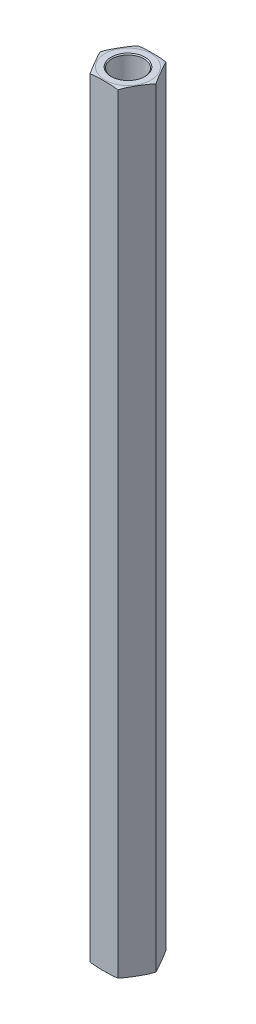
ISO-10303-21;
HEADER;
FILE_DESCRIPTION(('STEP AP214'),'2;1');
FILE_NAME('part.step','',(''),(''),'','','');
FILE_SCHEMA(('AUTOMOTIVE_DESIGN { 1 0 10303 214 1 1 1 1 }'));
ENDSEC;
DATA;
#1=APPLICATION_CONTEXT('core data for automotive mechanical design processes');
#2=APPLICATION_PROTOCOL_DEFINITION('international standard','automotive_design',2000,#1);
#3=PRODUCT_CONTEXT('',#1,'mechanical');
#4=PRODUCT('Part','Part','',(#3));
#5=PRODUCT_RELATED_PRODUCT_CATEGORY('part','',(#4));
#6=PRODUCT_DEFINITION_FORMATION('','',#4);
#7=PRODUCT_DEFINITION_CONTEXT('part definition',#1,'design');
#8=PRODUCT_DEFINITION('design','',#6,#7);
#9=PRODUCT_DEFINITION_SHAPE('','',#8);
#10=(LENGTH_UNIT() NAMED_UNIT(*) SI_UNIT(.MILLI.,.METRE.));
#11=(NAMED_UNIT(*) PLANE_ANGLE_UNIT() SI_UNIT($,.RADIAN.));
#12=(NAMED_UNIT(*) SI_UNIT($,.STERADIAN.) SOLID_ANGLE_UNIT());
#13=UNCERTAINTY_MEASURE_WITH_UNIT(LENGTH_MEASURE(1.E-05),#10,'distance_accuracy_value','');
#14=(GEOMETRIC_REPRESENTATION_CONTEXT(3) GLOBAL_UNCERTAINTY_ASSIGNED_CONTEXT((#13)) GLOBAL_UNIT_ASSIGNED_CONTEXT((#10,
#11,#12)) REPRESENTATION_CONTEXT('',''));
#15=CARTESIAN_POINT('',(0.,0.,0.));
#16=DIRECTION('',(0.,0.,1.));
#17=DIRECTION('',(1.,0.,0.));
#18=AXIS2_PLACEMENT_3D('',#15,#16,#17);
#19=CARTESIAN_POINT('',(0.,38.1,0.));
#20=DIRECTION('',(0.,1.,0.));
#21=DIRECTION('',(0.,0.,1.));
#22=AXIS2_PLACEMENT_3D('',#19,#20,#21);
#23=PLANE('',#22);
#24=CARTESIAN_POINT('',(0.,38.1,0.));
#25=DIRECTION('',(0.,1.,0.));
#26=DIRECTION('',(0.,0.,1.));
#27=AXIS2_PLACEMENT_3D('',#24,#25,#26);
#28=CIRCLE('',#27,2.0955);
#29=CARTESIAN_POINT('',(0.,38.1,2.0955));
#30=VERTEX_POINT('',#29);
#31=EDGE_CURVE('E437',#30,#30,#28,.T.);
#32=ORIENTED_EDGE('',*,*,#31,.T.);
#33=EDGE_LOOP('',(#32));
#34=FACE_BOUND('',#33,.T.);
#35=ADVANCED_FACE('F17',(#34),#23,.T.);
#36=CARTESIAN_POINT('',(0.,-38.1,0.));
#37=DIRECTION('',(0.,-1.,0.));
#38=DIRECTION('',(0.,0.,-1.));
#39=AXIS2_PLACEMENT_3D('',#36,#37,#38);
#40=PLANE('',#39);
#41=CARTESIAN_POINT('',(0.,-38.1,0.));
#42=DIRECTION('',(0.,-1.,0.));
#43=DIRECTION('',(0.,0.,-1.));
#44=AXIS2_PLACEMENT_3D('',#41,#42,#43);
#45=CIRCLE('',#44,2.0955);
#46=CARTESIAN_POINT('',(0.,-38.1,-2.0955));
#47=VERTEX_POINT('',#46);
#48=EDGE_CURVE('E130',#47,#47,#45,.T.);
#49=ORIENTED_EDGE('',*,*,#48,.T.);
#50=EDGE_LOOP('',(#49));
#51=FACE_BOUND('',#50,.T.);
#52=ADVANCED_FACE('F405',(#51),#40,.T.);
#53=CARTESIAN_POINT('',(0.,38.1,0.));
#54=DIRECTION('',(0.,1.,0.));
#55=DIRECTION('',(0.,0.,1.));
#56=AXIS2_PLACEMENT_3D('',#53,#54,#55);
#57=CYLINDRICAL_SURFACE('',#56,2.0955);
#58=CARTESIAN_POINT('',(0.,50.6729999999607,0.));
#59=DIRECTION('',(0.,1.,0.));
#60=DIRECTION('',(0.,0.,1.));
#61=AXIS2_PLACEMENT_3D('',#58,#59,#60);
#62=CIRCLE('',#61,2.09549999999581);
#63=CARTESIAN_POINT('',(0.,50.6729999999607,2.09549999999581));
#64=VERTEX_POINT('',#63);
#65=EDGE_CURVE('E128',#64,#64,#62,.T.);
#66=ORIENTED_EDGE('',*,*,#65,.T.);
#67=EDGE_LOOP('',(#66));
#68=FACE_BOUND('',#67,.T.);
#69=ORIENTED_EDGE('',*,*,#31,.F.);
#70=EDGE_LOOP('',(#69));
#71=FACE_BOUND('',#70,.T.);
#72=ADVANCED_FACE('F396',(#68,#71),#57,.F.);
#73=CARTESIAN_POINT('',(0.,-38.1,0.));
#74=DIRECTION('',(0.,-1.,0.));
#75=DIRECTION('',(0.,0.,-1.));
#76=AXIS2_PLACEMENT_3D('',#73,#74,#75);
#77=CYLINDRICAL_SURFACE('',#76,2.0955);
#78=ORIENTED_EDGE('',*,*,#48,.F.);
#79=EDGE_LOOP('',(#78));
#80=FACE_BOUND('',#79,.T.);
#81=CARTESIAN_POINT('',(0.,-50.6729999999607,0.));
#82=DIRECTION('',(0.,-1.,0.));
#83=DIRECTION('',(0.,0.,-1.));
#84=AXIS2_PLACEMENT_3D('',#81,#82,#83);
#85=CIRCLE('',#84,2.09550000005265);
#86=CARTESIAN_POINT('',(0.,-50.6729999999607,-2.09550000005265));
#87=VERTEX_POINT('',#86);
#88=EDGE_CURVE('E93',#87,#87,#85,.T.);
#89=ORIENTED_EDGE('',*,*,#88,.T.);
#90=EDGE_LOOP('',(#89));
#91=FACE_BOUND('',#90,.T.);
#92=ADVANCED_FACE('F387',(#80,#91),#77,.F.);
#93=CARTESIAN_POINT('',(0.,50.7999999999811,0.));
#94=DIRECTION('',(0.,1.,0.));
#95=DIRECTION('',(0.,0.,1.));
#96=AXIS2_PLACEMENT_3D('',#93,#94,#95);
#97=CONICAL_SURFACE('',#96,2.22249999995938,0.785398163173655);
#98=CARTESIAN_POINT('',(0.,50.7999999999811,0.));
#99=DIRECTION('',(0.,1.,0.));
#100=DIRECTION('',(0.,0.,1.));
#101=AXIS2_PLACEMENT_3D('',#98,#99,#100);
#102=CIRCLE('',#101,2.22249999995938);
#103=CARTESIAN_POINT('',(0.,50.7999999999811,2.22249999995938));
#104=VERTEX_POINT('',#103);
#105=EDGE_CURVE('E205',#104,#104,#102,.T.);
#106=ORIENTED_EDGE('',*,*,#105,.T.);
#107=EDGE_LOOP('',(#106));
#108=FACE_BOUND('',#107,.T.);
#109=ORIENTED_EDGE('',*,*,#65,.F.);
#110=EDGE_LOOP('',(#109));
#111=FACE_BOUND('',#110,.T.);
#112=ADVANCED_FACE('F379',(#108,#111),#97,.F.);
#113=CARTESIAN_POINT('',(0.,-50.7999999999242,0.));
#114=DIRECTION('',(0.,-1.,0.));
#115=DIRECTION('',(1.,0.,0.));
#116=AXIS2_PLACEMENT_3D('',#113,#114,#115);
#117=CONICAL_SURFACE('',#116,2.22249999995938,0.785398163397448);
#118=ORIENTED_EDGE('',*,*,#88,.F.);
#119=EDGE_LOOP('',(#118));
#120=FACE_BOUND('',#119,.T.);
#121=CARTESIAN_POINT('',(0.,-50.7999999999811,0.));
#122=DIRECTION('',(0.,-1.,0.));
#123=DIRECTION('',(1.,0.,0.));
#124=AXIS2_PLACEMENT_3D('',#121,#122,#123);
#125=CIRCLE('',#124,2.22250000001623);
#126=CARTESIAN_POINT('',(2.22250000001623,-50.7999999999811,0.));
#127=VERTEX_POINT('',#126);
#128=EDGE_CURVE('E200',#127,#127,#125,.F.);
#129=ORIENTED_EDGE('',*,*,#128,.F.);
#130=EDGE_LOOP('',(#129));
#131=FACE_BOUND('',#130,.T.);
#132=ADVANCED_FACE('F372',(#120,#131),#117,.F.);
#133=CARTESIAN_POINT('',(1.83308710467706,50.8,3.17499999999999));
#134=DIRECTION('',(-0.866025403784439,0.,-0.5));
#135=DIRECTION('',(-0.5,0.,0.866025403784439));
#136=AXIS2_PLACEMENT_3D('',#133,#134,#135);
#137=PLANE('',#136);
#138=DIRECTION('',(0.,1.,0.));
#139=VECTOR('',#138,1.);
#140=CARTESIAN_POINT('',(3.66617420935412,50.8,0.));
#141=LINE('',#140,#139);
#142=CARTESIAN_POINT('',(3.66617420935412,-50.673,0.));
#143=VERTEX_POINT('',#142);
#144=CARTESIAN_POINT('',(3.66617420935412,50.673,0.));
#145=VERTEX_POINT('',#144);
#146=EDGE_CURVE('E75',#143,#145,#141,.T.);
#147=ORIENTED_EDGE('',*,*,#146,.T.);
#148=CARTESIAN_POINT('',(1.83308710467706,50.673,3.175));
#149=CARTESIAN_POINT('',(1.87128169935724,50.6889014148997,3.10884502143944));
#150=CARTESIAN_POINT('',(1.90969320538961,50.7024886076105,3.04231434139612));
#151=CARTESIAN_POINT('',(1.98677079607407,50.7258161979402,2.90881203820563));
#152=CARTESIAN_POINT('',(2.02543658353272,50.7355604771397,2.8418409298126));
#153=CARTESIAN_POINT('',(2.10284499535245,50.7519966530451,2.70776562760761));
#154=CARTESIAN_POINT('',(2.14158731769806,50.7586945328669,2.64066195690181));
#155=CARTESIAN_POINT('',(2.21916296783005,50.7697767572932,2.50629698944301));
#156=CARTESIAN_POINT('',(2.25799631815347,50.774160450474,2.43903565365472));
#157=CARTESIAN_POINT('',(2.33572065438804,50.7812403004263,2.30441315431189));
#158=CARTESIAN_POINT('',(2.37461166028642,50.7839355237591,2.23705195613842));
#159=CARTESIAN_POINT('',(2.45240986808526,50.7881531983713,2.10230150749304));
#160=CARTESIAN_POINT('',(2.49131707051149,50.7896756080272,2.03491225611044));
#161=CARTESIAN_POINT('',(2.56874613804245,50.791922705889,1.90080117716413));
#162=CARTESIAN_POINT('',(2.60726795154184,50.7926552468181,1.8340794389835));
#163=CARTESIAN_POINT('',(2.68431353056975,50.7935767302574,1.7006325816086));
#164=CARTESIAN_POINT('',(2.72283729611679,50.7937656658949,1.63390746238225));
#165=CARTESIAN_POINT('',(2.79990166972106,50.7936659966806,1.50042805184618));
#166=CARTESIAN_POINT('',(2.83844227771297,50.7933771811766,1.4336737606496));
#167=CARTESIAN_POINT('',(2.91552223317789,50.792221986219,1.30016736153922));
#168=CARTESIAN_POINT('',(2.95406158061873,50.7913555970386,1.23341525368112));
#169=CARTESIAN_POINT('',(3.03113161773348,50.7887861940656,1.09992603365716));
#170=CARTESIAN_POINT('',(3.06966230777154,50.7870832271616,1.03318892086056));
#171=CARTESIAN_POINT('',(3.1467048006221,50.7824387229726,0.899747408901619));
#172=CARTESIAN_POINT('',(3.18521660427676,50.7794972471358,0.833043008280634));
#173=CARTESIAN_POINT('',(3.24841925163174,50.7732174124749,0.723572811888951));
#174=CARTESIAN_POINT('',(3.27312282066109,50.7703980110463,0.680784975201837));
#175=CARTESIAN_POINT('',(3.32249186130891,50.7638696794304,0.595275288478879));
#176=CARTESIAN_POINT('',(3.34715734368935,50.7601610809139,0.552553419802756));
#177=CARTESIAN_POINT('',(3.39643377591422,50.7516802711497,0.467204135573549));
#178=CARTESIAN_POINT('',(3.42104474295589,50.7469084657008,0.424576690233975));
#179=CARTESIAN_POINT('',(3.47026036719569,50.7360987712516,0.339332728524436));
#180=CARTESIAN_POINT('',(3.49486485317655,50.7300577313084,0.296716508711466));
#181=CARTESIAN_POINT('',(3.54398805502185,50.7165138354161,0.211632627284947));
#182=CARTESIAN_POINT('',(3.56850671785504,50.709010197803,0.169165057524208));
#183=CARTESIAN_POINT('',(3.61743974029947,50.6923203507084,0.0844105764825507));
#184=CARTESIAN_POINT('',(3.64185387349848,50.6831314978033,0.0421240573591031));
#185=CARTESIAN_POINT('',(3.66617420935412,50.673,0.));
#186=B_SPLINE_CURVE_WITH_KNOTS('',3,(#148,#149,#150,#151,#152,#153,#154,#155,#156,#157,#158,
#159,#160,#161,#162,#163,#164,#165,#166,#167,#168,#169,#170,#171,#172,#173,#174,#175,#176,#177,
#178,#179,#180,#181,#182,#183,#184,#185),.UNSPECIFIED.,.F.,.F.,(4,2,2,2,2,2,2,2,2,2,2,2,2,2,2,2,
2,2,4),(0.,0.233977307817941,0.467717675040694,0.7009969735575,0.934341903229751,
1.1678157196724,1.40129782179825,1.6324366580967,1.86357841666617,2.09482211846294,
2.32606971471495,2.55730435147398,2.78852751694413,2.93698369265087,3.08538458004473,
3.23372892334584,3.38244598546612,3.53124274626083,3.68027493713584),.UNSPECIFIED.);
#187=CARTESIAN_POINT('',(1.83308710467706,50.673,3.17499999999999));
#188=VERTEX_POINT('',#187);
#189=EDGE_CURVE('E99',#188,#145,#186,.T.);
#190=ORIENTED_EDGE('',*,*,#189,.F.);
#191=DIRECTION('',(0.,1.,0.));
#192=VECTOR('',#191,1.);
#193=CARTESIAN_POINT('',(1.83308710467706,50.8,3.17499999999999));
#194=LINE('',#193,#192);
#195=CARTESIAN_POINT('',(1.83308710467706,-50.673,3.17499999999999));
#196=VERTEX_POINT('',#195);
#197=EDGE_CURVE('E92',#188,#196,#194,.F.);
#198=ORIENTED_EDGE('',*,*,#197,.T.);
#199=CARTESIAN_POINT('',(3.66617420935412,-50.673,0.));
#200=CARTESIAN_POINT('',(3.62797961467395,-50.6889014148997,0.066154978560558));
#201=CARTESIAN_POINT('',(3.58956810864157,-50.7024886076105,0.132685658603875));
#202=CARTESIAN_POINT('',(3.51249051795711,-50.7258161979402,0.266187961794359));
#203=CARTESIAN_POINT('',(3.47382473049846,-50.7355604771397,0.33315907018739));
#204=CARTESIAN_POINT('',(3.39641631867873,-50.7519966530451,0.467234372392382));
#205=CARTESIAN_POINT('',(3.35767399633312,-50.7586945328669,0.534338043098185));
#206=CARTESIAN_POINT('',(3.28009834620113,-50.7697767572932,0.668703010556983));
#207=CARTESIAN_POINT('',(3.24126499587771,-50.774160450474,0.735964346345271));
#208=CARTESIAN_POINT('',(3.16354065964315,-50.7812403004263,0.870586845688102));
#209=CARTESIAN_POINT('',(3.12464965374476,-50.7839355237591,0.937948043861573));
#210=CARTESIAN_POINT('',(3.04685144594593,-50.7881531983713,1.07269849250695));
#211=CARTESIAN_POINT('',(3.00794424351969,-50.7896756080272,1.14008774388956));
#212=CARTESIAN_POINT('',(2.93051517598873,-50.791922705889,1.27419882283586));
#213=CARTESIAN_POINT('',(2.89199336248934,-50.7926552468181,1.34092056101649));
#214=CARTESIAN_POINT('',(2.81494778346143,-50.7935767302574,1.4743674183914));
#215=CARTESIAN_POINT('',(2.77642401791439,-50.7937656658949,1.54109253761775));
#216=CARTESIAN_POINT('',(2.69935964431012,-50.7936659966806,1.67457194815381));
#217=CARTESIAN_POINT('',(2.66081903631821,-50.7933771811766,1.7413262393504));
#218=CARTESIAN_POINT('',(2.58373908085329,-50.792221986219,1.87483263846078));
#219=CARTESIAN_POINT('',(2.54519973341245,-50.7913555970386,1.94158474631887));
#220=CARTESIAN_POINT('',(2.4681296962977,-50.7887861940656,2.07507396634283));
#221=CARTESIAN_POINT('',(2.42959900625965,-50.7870832271616,2.14181107913943));
#222=CARTESIAN_POINT('',(2.35255651340908,-50.7824387229726,2.27525259109837));
#223=CARTESIAN_POINT('',(2.31404470975442,-50.7794972471358,2.34195699171936));
#224=CARTESIAN_POINT('',(2.25084206239944,-50.7732174124749,2.45142718811104));
#225=CARTESIAN_POINT('',(2.2261384933701,-50.7703980110463,2.49421502479816));
#226=CARTESIAN_POINT('',(2.17676945272228,-50.7638696794304,2.57972471152112));
#227=CARTESIAN_POINT('',(2.15210397034183,-50.7601610809139,2.62244658019724));
#228=CARTESIAN_POINT('',(2.10282753811696,-50.7516802711497,2.70779586442645));
#229=CARTESIAN_POINT('',(2.07821657107529,-50.7469084657008,2.75042330976602));
#230=CARTESIAN_POINT('',(2.02900094683549,-50.7360987712516,2.83566727147556));
#231=CARTESIAN_POINT('',(2.00439646085463,-50.7300577313084,2.87828349128853));
#232=CARTESIAN_POINT('',(1.95527325900933,-50.7165138354161,2.96336737271505));
#233=CARTESIAN_POINT('',(1.93075459617614,-50.709010197803,3.00583494247579));
#234=CARTESIAN_POINT('',(1.88182157373171,-50.6923203507084,3.09058942351745));
#235=CARTESIAN_POINT('',(1.8574074405327,-50.6831314978033,3.13287594264089));
#236=CARTESIAN_POINT('',(1.83308710467706,-50.673,3.175));
#237=B_SPLINE_CURVE_WITH_KNOTS('',3,(#199,#200,#201,#202,#203,#204,#205,#206,#207,#208,#209,
#210,#211,#212,#213,#214,#215,#216,#217,#218,#219,#220,#221,#222,#223,#224,#225,#226,#227,#228,
#229,#230,#231,#232,#233,#234,#235,#236),.UNSPECIFIED.,.F.,.F.,(4,2,2,2,2,2,2,2,2,2,2,2,2,2,2,2,
2,2,4),(0.,0.233977307817942,0.467717675040694,0.7009969735575,0.934341903229751,
1.1678157196724,1.40129782179825,1.6324366580967,1.86357841666617,2.09482211846294,
2.32606971471495,2.55730435147398,2.78852751694413,2.93698369265087,3.08538458004473,
3.23372892334584,3.38244598546612,3.53124274626084,3.68027493713585),.UNSPECIFIED.);
#238=EDGE_CURVE('E86',#143,#196,#237,.T.);
#239=ORIENTED_EDGE('',*,*,#238,.F.);
#240=EDGE_LOOP('',(#147,#190,#198,#239));
#241=FACE_BOUND('',#240,.T.);
#242=ADVANCED_FACE('F90',(#241),#137,.F.);
#243=CARTESIAN_POINT('',(3.66617420935412,50.8,0.));
#244=DIRECTION('',(-0.866025403784439,0.,0.5));
#245=DIRECTION('',(0.5,0.,0.866025403784439));
#246=AXIS2_PLACEMENT_3D('',#243,#244,#245);
#247=PLANE('',#246);
#248=DIRECTION('',(0.,1.,0.));
#249=VECTOR('',#248,1.);
#250=CARTESIAN_POINT('',(1.83308710467706,50.8,-3.175));
#251=LINE('',#250,#249);
#252=CARTESIAN_POINT('',(1.83308710467706,-50.673,-3.175));
#253=VERTEX_POINT('',#252);
#254=CARTESIAN_POINT('',(1.83308710467706,50.673,-3.175));
#255=VERTEX_POINT('',#254);
#256=EDGE_CURVE('E164',#253,#255,#251,.T.);
#257=ORIENTED_EDGE('',*,*,#256,.T.);
#258=CARTESIAN_POINT('',(3.66617420935412,50.673,0.));
#259=CARTESIAN_POINT('',(3.62797961467395,50.6889014148997,-0.0661549785605553));
#260=CARTESIAN_POINT('',(3.58956810864157,50.7024886076105,-0.132685658603872));
#261=CARTESIAN_POINT('',(3.51249051795711,50.7258161979402,-0.266187961794356));
#262=CARTESIAN_POINT('',(3.47382473049846,50.7355604771397,-0.333159070187387));
#263=CARTESIAN_POINT('',(3.39641631867873,50.7519966530451,-0.467234372392379));
#264=CARTESIAN_POINT('',(3.35767399633312,50.7586945328669,-0.534338043098182));
#265=CARTESIAN_POINT('',(3.28009834620113,50.7697767572932,-0.66870301055698));
#266=CARTESIAN_POINT('',(3.24126499587771,50.774160450474,-0.735964346345267));
#267=CARTESIAN_POINT('',(3.16354065964315,50.7812403004263,-0.870586845688098));
#268=CARTESIAN_POINT('',(3.12464965374476,50.7839355237591,-0.937948043861569));
#269=CARTESIAN_POINT('',(3.04685144594593,50.7881531983713,-1.07269849250695));
#270=CARTESIAN_POINT('',(3.00794424351969,50.7896756080272,-1.14008774388955));
#271=CARTESIAN_POINT('',(2.93051517598873,50.791922705889,-1.27419882283586));
#272=CARTESIAN_POINT('',(2.89199336248934,50.7926552468181,-1.34092056101649));
#273=CARTESIAN_POINT('',(2.81494778346143,50.7935767302574,-1.47436741839139));
#274=CARTESIAN_POINT('',(2.77642401791439,50.7937656658949,-1.54109253761774));
#275=CARTESIAN_POINT('',(2.69935964431012,50.7936659966806,-1.67457194815381));
#276=CARTESIAN_POINT('',(2.66081903631821,50.7933771811766,-1.74132623935039));
#277=CARTESIAN_POINT('',(2.58373908085329,50.792221986219,-1.87483263846077));
#278=CARTESIAN_POINT('',(2.54519973341245,50.7913555970386,-1.94158474631887));
#279=CARTESIAN_POINT('',(2.4681296962977,50.7887861940656,-2.07507396634283));
#280=CARTESIAN_POINT('',(2.42959900625965,50.7870832271616,-2.14181107913943));
#281=CARTESIAN_POINT('',(2.35255651340908,50.7824387229726,-2.27525259109837));
#282=CARTESIAN_POINT('',(2.31404470975442,50.7794972471358,-2.34195699171935));
#283=CARTESIAN_POINT('',(2.25084206239944,50.7732174124749,-2.45142718811104));
#284=CARTESIAN_POINT('',(2.2261384933701,50.7703980110463,-2.49421502479815));
#285=CARTESIAN_POINT('',(2.17676945272227,50.7638696794304,-2.57972471152111));
#286=CARTESIAN_POINT('',(2.15210397034183,50.7601610809139,-2.62244658019724));
#287=CARTESIAN_POINT('',(2.10282753811695,50.7516802711497,-2.70779586442645));
#288=CARTESIAN_POINT('',(2.07821657107529,50.7469084657008,-2.75042330976602));
#289=CARTESIAN_POINT('',(2.02900094683549,50.7360987712516,-2.83566727147556));
#290=CARTESIAN_POINT('',(2.00439646085463,50.7300577313084,-2.87828349128853));
#291=CARTESIAN_POINT('',(1.95527325900933,50.7165138354161,-2.96336737271505));
#292=CARTESIAN_POINT('',(1.93075459617614,50.709010197803,-3.00583494247579));
#293=CARTESIAN_POINT('',(1.88182157373171,50.6923203507084,-3.09058942351745));
#294=CARTESIAN_POINT('',(1.85740744053269,50.6831314978033,-3.1328759426409));
#295=CARTESIAN_POINT('',(1.83308710467705,50.673,-3.175));
#296=B_SPLINE_CURVE_WITH_KNOTS('',3,(#258,#259,#260,#261,#262,#263,#264,#265,#266,#267,#268,
#269,#270,#271,#272,#273,#274,#275,#276,#277,#278,#279,#280,#281,#282,#283,#284,#285,#286,#287,
#288,#289,#290,#291,#292,#293,#294,#295),.UNSPECIFIED.,.F.,.F.,(4,2,2,2,2,2,2,2,2,2,2,2,2,2,2,2,
2,2,4),(0.,0.233977307817942,0.467717675040694,0.7009969735575,0.93434190322975,1.1678157196724,
1.40129782179824,1.63243665809669,1.86357841666617,2.09482211846294,2.32606971471494,
2.55730435147397,2.78852751694413,2.93698369265087,3.08538458004474,3.23372892334585,
3.38244598546613,3.53124274626085,3.68027493713586),.UNSPECIFIED.);
#297=EDGE_CURVE('E83',#145,#255,#296,.T.);
#298=ORIENTED_EDGE('',*,*,#297,.F.);
#299=ORIENTED_EDGE('',*,*,#146,.F.);
#300=CARTESIAN_POINT('',(1.83308710467706,-50.673,-3.175));
#301=CARTESIAN_POINT('',(1.87128169935723,-50.6889014148997,-3.10884502143944));
#302=CARTESIAN_POINT('',(1.90969320538961,-50.7024886076105,-3.04231434139612));
#303=CARTESIAN_POINT('',(1.98677079607407,-50.7258161979402,-2.90881203820564));
#304=CARTESIAN_POINT('',(2.02543658353271,-50.7355604771397,-2.84184092981261));
#305=CARTESIAN_POINT('',(2.10284499535244,-50.7519966530451,-2.70776562760762));
#306=CARTESIAN_POINT('',(2.14158731769805,-50.7586945328669,-2.64066195690181));
#307=CARTESIAN_POINT('',(2.21916296783004,-50.7697767572932,-2.50629698944302));
#308=CARTESIAN_POINT('',(2.25799631815347,-50.774160450474,-2.43903565365473));
#309=CARTESIAN_POINT('',(2.33572065438803,-50.7812403004263,-2.3044131543119));
#310=CARTESIAN_POINT('',(2.37461166028642,-50.7839355237591,-2.23705195613843));
#311=CARTESIAN_POINT('',(2.45240986808525,-50.7881531983713,-2.10230150749305));
#312=CARTESIAN_POINT('',(2.49131707051148,-50.7896756080272,-2.03491225611045));
#313=CARTESIAN_POINT('',(2.56874613804245,-50.791922705889,-1.90080117716414));
#314=CARTESIAN_POINT('',(2.60726795154183,-50.7926552468181,-1.83407943898351));
#315=CARTESIAN_POINT('',(2.68431353056974,-50.7935767302574,-1.70063258160861));
#316=CARTESIAN_POINT('',(2.72283729611679,-50.7937656658949,-1.63390746238225));
#317=CARTESIAN_POINT('',(2.79990166972105,-50.7936659966806,-1.50042805184619));
#318=CARTESIAN_POINT('',(2.83844227771296,-50.7933771811766,-1.43367376064961));
#319=CARTESIAN_POINT('',(2.91552223317788,-50.792221986219,-1.30016736153923));
#320=CARTESIAN_POINT('',(2.95406158061872,-50.7913555970386,-1.23341525368113));
#321=CARTESIAN_POINT('',(3.03113161773347,-50.7887861940656,-1.09992603365718));
#322=CARTESIAN_POINT('',(3.06966230777153,-50.7870832271616,-1.03318892086057));
#323=CARTESIAN_POINT('',(3.14670480062209,-50.7824387229726,-0.899747408901631));
#324=CARTESIAN_POINT('',(3.18521660427675,-50.7794972471358,-0.833043008280646));
#325=CARTESIAN_POINT('',(3.24841925163173,-50.7732174124749,-0.723572811888963));
#326=CARTESIAN_POINT('',(3.27312282066108,-50.7703980110463,-0.680784975201848));
#327=CARTESIAN_POINT('',(3.3224918613089,-50.7638696794304,-0.595275288478888));
#328=CARTESIAN_POINT('',(3.34715734368934,-50.7601610809139,-0.552553419802764));
#329=CARTESIAN_POINT('',(3.39643377591422,-50.7516802711497,-0.467204135573556));
#330=CARTESIAN_POINT('',(3.42104474295589,-50.7469084657008,-0.424576690233981));
#331=CARTESIAN_POINT('',(3.47026036719568,-50.7360987712516,-0.33933272852444));
#332=CARTESIAN_POINT('',(3.49486485317654,-50.7300577313084,-0.296716508711469));
#333=CARTESIAN_POINT('',(3.54398805502184,-50.7165138354161,-0.211632627284948));
#334=CARTESIAN_POINT('',(3.56850671785504,-50.709010197803,-0.169165057524208));
#335=CARTESIAN_POINT('',(3.61743974029947,-50.6923203507084,-0.0844105764825488));
#336=CARTESIAN_POINT('',(3.64185387349848,-50.6831314978033,-0.0421240573591002));
#337=CARTESIAN_POINT('',(3.66617420935412,-50.673,0.));
#338=B_SPLINE_CURVE_WITH_KNOTS('',3,(#300,#301,#302,#303,#304,#305,#306,#307,#308,#309,#310,
#311,#312,#313,#314,#315,#316,#317,#318,#319,#320,#321,#322,#323,#324,#325,#326,#327,#328,#329,
#330,#331,#332,#333,#334,#335,#336,#337),.UNSPECIFIED.,.F.,.F.,(4,2,2,2,2,2,2,2,2,2,2,2,2,2,2,2,
2,2,4),(0.,0.233977307817941,0.467717675040692,0.700996973557498,0.934341903229747,
1.16781571967239,1.40129782179824,1.63243665809669,1.86357841666616,2.09482211846293,
2.32606971471494,2.55730435147397,2.78852751694412,2.93698369265086,3.08538458004473,
3.23372892334584,3.38244598546612,3.53124274626084,3.68027493713585),.UNSPECIFIED.);
#339=EDGE_CURVE('E80',#253,#143,#338,.T.);
#340=ORIENTED_EDGE('',*,*,#339,.F.);
#341=EDGE_LOOP('',(#257,#298,#299,#340));
#342=FACE_BOUND('',#341,.T.);
#343=ADVANCED_FACE('F78',(#342),#247,.F.);
#344=CARTESIAN_POINT('',(-1.83308710467707,50.8,-3.175));
#345=DIRECTION('',(0.,-1.,0.));
#346=DIRECTION('',(0.,0.,-1.));
#347=AXIS2_PLACEMENT_3D('',#344,#345,#346);
#348=PLANE('',#347);
#349=CARTESIAN_POINT('',(0.,50.8,0.));
#350=DIRECTION('',(0.,-1.,0.));
#351=DIRECTION('',(0.,0.,1.));
#352=AXIS2_PLACEMENT_3D('',#349,#350,#351);
#353=CIRCLE('',#352,3.03117420935412);
#354=CARTESIAN_POINT('',(0.,50.8,3.03117420935412));
#355=VERTEX_POINT('',#354);
#356=CARTESIAN_POINT('',(0.,50.8,-3.03117420935412));
#357=VERTEX_POINT('',#356);
#358=EDGE_CURVE('E241',#355,#357,#353,.T.);
#359=ORIENTED_EDGE('',*,*,#358,.F.);
#360=CARTESIAN_POINT('',(0.,50.8,0.));
#361=DIRECTION('',(0.,-1.,0.));
#362=DIRECTION('',(0.,0.,-1.));
#363=AXIS2_PLACEMENT_3D('',#360,#361,#362);
#364=CIRCLE('',#363,3.03117420935412);
#365=EDGE_CURVE('E204',#357,#355,#364,.T.);
#366=ORIENTED_EDGE('',*,*,#365,.F.);
#367=EDGE_LOOP('',(#359,#366));
#368=FACE_BOUND('',#367,.T.);
#369=ORIENTED_EDGE('',*,*,#105,.F.);
#370=EDGE_LOOP('',(#369));
#371=FACE_BOUND('',#370,.T.);
#372=ADVANCED_FACE('F212',(#368,#371),#348,.F.);
#373=CARTESIAN_POINT('',(-1.83308710467707,-50.8,-3.175));
#374=DIRECTION('',(0.,-1.,0.));
#375=DIRECTION('',(0.,0.,-1.));
#376=AXIS2_PLACEMENT_3D('',#373,#374,#375);
#377=PLANE('',#376);
#378=CARTESIAN_POINT('',(0.,-50.8,0.));
#379=DIRECTION('',(0.,1.,0.));
#380=DIRECTION('',(0.,0.,1.));
#381=AXIS2_PLACEMENT_3D('',#378,#379,#380);
#382=CIRCLE('',#381,3.03117420935412);
#383=CARTESIAN_POINT('',(0.,-50.8,-3.03117420935412));
#384=VERTEX_POINT('',#383);
#385=CARTESIAN_POINT('',(0.,-50.8,3.03117420935412));
#386=VERTEX_POINT('',#385);
#387=EDGE_CURVE('E203',#384,#386,#382,.F.);
#388=ORIENTED_EDGE('',*,*,#387,.T.);
#389=CARTESIAN_POINT('',(0.,-50.8,0.));
#390=DIRECTION('',(0.,1.,0.));
#391=DIRECTION('',(0.,0.,-1.));
#392=AXIS2_PLACEMENT_3D('',#389,#390,#391);
#393=CIRCLE('',#392,3.03117420935412);
#394=EDGE_CURVE('E268',#384,#386,#393,.T.);
#395=ORIENTED_EDGE('',*,*,#394,.F.);
#396=EDGE_LOOP('',(#388,#395));
#397=FACE_BOUND('',#396,.T.);
#398=ORIENTED_EDGE('',*,*,#128,.T.);
#399=EDGE_LOOP('',(#398));
#400=FACE_BOUND('',#399,.T.);
#401=ADVANCED_FACE('F218',(#397,#400),#377,.T.);
#402=CARTESIAN_POINT('',(-1.83308710467707,50.8,3.175));
#403=DIRECTION('',(0.,0.,-1.));
#404=DIRECTION('',(-1.,0.,0.));
#405=AXIS2_PLACEMENT_3D('',#402,#403,#404);
#406=PLANE('',#405);
#407=ORIENTED_EDGE('',*,*,#197,.F.);
#408=CARTESIAN_POINT('',(-1.83308710467706,50.673,3.175));
#409=CARTESIAN_POINT('',(-1.73237579828684,50.6939400141518,3.175));
#410=CARTESIAN_POINT('',(-1.63096506893486,50.7108853495327,3.175));
#411=CARTESIAN_POINT('',(-1.42767146651469,50.7384971643984,3.175));
#412=CARTESIAN_POINT('',(-1.32579191427254,50.7491875658753,3.175));
#413=CARTESIAN_POINT('',(-1.12177634709138,50.7661280408079,3.175));
#414=CARTESIAN_POINT('',(-1.0196405664338,50.7723812707189,3.175));
#415=CARTESIAN_POINT('',(-0.815663681397378,50.7819028064183,3.175));
#416=CARTESIAN_POINT('',(-0.713823115514575,50.7851834044999,3.175));
#417=CARTESIAN_POINT('',(-0.510018485441652,50.7899454848703,3.175));
#418=CARTESIAN_POINT('',(-0.408054390577978,50.7914254100882,3.175));
#419=CARTESIAN_POINT('',(-0.204060200337871,50.7933146818379,3.175));
#420=CARTESIAN_POINT('',(-0.102030100168935,50.7937234241492,3.175));
#421=CARTESIAN_POINT('',(0.102030100168936,50.7937234241492,3.175));
#422=CARTESIAN_POINT('',(0.204060200337871,50.7933146818379,3.175));
#423=CARTESIAN_POINT('',(0.408054390577978,50.7914254100882,3.17499999999999));
#424=CARTESIAN_POINT('',(0.510018485441653,50.7899454848703,3.17499999999999));
#425=CARTESIAN_POINT('',(0.713823115514576,50.7851834044999,3.17499999999999));
#426=CARTESIAN_POINT('',(0.815663681397379,50.7819028064183,3.17499999999999));
#427=CARTESIAN_POINT('',(1.0196405664338,50.7723812707189,3.17499999999999));
#428=CARTESIAN_POINT('',(1.12177634709138,50.7661280408079,3.17499999999999));
#429=CARTESIAN_POINT('',(1.32579191427254,50.7491875658753,3.17499999999999));
#430=CARTESIAN_POINT('',(1.4276714665147,50.7384971643984,3.17499999999999));
#431=CARTESIAN_POINT('',(1.63096506893487,50.7108853495327,3.17499999999999));
#432=CARTESIAN_POINT('',(1.73237579828684,50.6939400141518,3.17499999999999));
#433=CARTESIAN_POINT('',(1.83308710467707,50.673,3.17499999999999));
#434=B_SPLINE_CURVE_WITH_KNOTS('',3,(#408,#409,#410,#411,#412,#413,#414,#415,#416,#417,#418,
#419,#420,#421,#422,#423,#424,#425,#426,#427,#428,#429,#430,#431,#432,#433),.UNSPECIFIED.,.F.,
.F.,(4,2,2,2,2,2,2,2,2,2,2,2,4),(0.,0.308333242342809,0.615479423308237,0.922406891130011,
1.2280592962085,1.53397581645216,1.84006485747889,2.14615389850562,2.45207041874928,
2.75772282382777,3.06465029164955,3.37179647261498,3.68012971495779),.UNSPECIFIED.);
#435=CARTESIAN_POINT('',(-1.83308710467706,50.673,3.175));
#436=VERTEX_POINT('',#435);
#437=EDGE_CURVE('E190',#436,#188,#434,.T.);
#438=ORIENTED_EDGE('',*,*,#437,.F.);
#439=DIRECTION('',(0.,1.,0.));
#440=VECTOR('',#439,1.);
#441=CARTESIAN_POINT('',(-1.83308710467707,50.8,3.175));
#442=LINE('',#441,#440);
#443=CARTESIAN_POINT('',(-1.83308710467708,-50.673,3.17499999999999));
#444=VERTEX_POINT('',#443);
#445=EDGE_CURVE('E158',#436,#444,#442,.F.);
#446=ORIENTED_EDGE('',*,*,#445,.T.);
#447=CARTESIAN_POINT('',(1.83308710467706,-50.673,3.17499999999999));
#448=CARTESIAN_POINT('',(1.73237579828684,-50.6939400141518,3.17499999999999));
#449=CARTESIAN_POINT('',(1.63096506893486,-50.7108853495327,3.17499999999999));
#450=CARTESIAN_POINT('',(1.4276714665147,-50.7384971643984,3.17499999999999));
#451=CARTESIAN_POINT('',(1.32579191427254,-50.7491875658753,3.17499999999999));
#452=CARTESIAN_POINT('',(1.12177634709138,-50.7661280408079,3.17499999999999));
#453=CARTESIAN_POINT('',(1.0196405664338,-50.7723812707189,3.17499999999999));
#454=CARTESIAN_POINT('',(0.815663681397379,-50.7819028064183,3.17499999999999));
#455=CARTESIAN_POINT('',(0.713823115514576,-50.7851834044999,3.17499999999999));
#456=CARTESIAN_POINT('',(0.510018485441653,-50.7899454848703,3.17499999999999));
#457=CARTESIAN_POINT('',(0.408054390577978,-50.7914254100882,3.17499999999999));
#458=CARTESIAN_POINT('',(0.204060200337871,-50.7933146818379,3.175));
#459=CARTESIAN_POINT('',(0.102030100168936,-50.7937234241492,3.175));
#460=CARTESIAN_POINT('',(-0.102030100168936,-50.7937234241492,3.175));
#461=CARTESIAN_POINT('',(-0.204060200337873,-50.7933146818379,3.175));
#462=CARTESIAN_POINT('',(-0.408054390577981,-50.7914254100882,3.175));
#463=CARTESIAN_POINT('',(-0.510018485441657,-50.7899454848703,3.175));
#464=CARTESIAN_POINT('',(-0.713823115514581,-50.7851834044999,3.175));
#465=CARTESIAN_POINT('',(-0.815663681397385,-50.7819028064183,3.175));
#466=CARTESIAN_POINT('',(-1.01964056643381,-50.7723812707189,3.175));
#467=CARTESIAN_POINT('',(-1.12177634709139,-50.7661280408079,3.175));
#468=CARTESIAN_POINT('',(-1.32579191427255,-50.7491875658753,3.175));
#469=CARTESIAN_POINT('',(-1.42767146651471,-50.7384971643984,3.175));
#470=CARTESIAN_POINT('',(-1.63096506893487,-50.7108853495327,3.175));
#471=CARTESIAN_POINT('',(-1.73237579828685,-50.6939400141518,3.175));
#472=CARTESIAN_POINT('',(-1.83308710467708,-50.673,3.175));
#473=B_SPLINE_CURVE_WITH_KNOTS('',3,(#447,#448,#449,#450,#451,#452,#453,#454,#455,#456,#457,
#458,#459,#460,#461,#462,#463,#464,#465,#466,#467,#468,#469,#470,#471,#472),.UNSPECIFIED.,.F.,
.F.,(4,2,2,2,2,2,2,2,2,2,2,2,4),(0.,0.308333242342809,0.615479423308237,0.922406891130012,
1.22805929620851,1.53397581645217,1.84006485747889,2.14615389850563,2.45207041874929,
2.75772282382778,3.06465029164956,3.37179647261499,3.6801297149578),.UNSPECIFIED.);
#474=EDGE_CURVE('E251',#196,#444,#473,.T.);
#475=ORIENTED_EDGE('',*,*,#474,.F.);
#476=EDGE_LOOP('',(#407,#438,#446,#475));
#477=FACE_BOUND('',#476,.T.);
#478=ADVANCED_FACE('F250',(#477),#406,.F.);
#479=CARTESIAN_POINT('',(1.83308710467706,50.8,-3.175));
#480=DIRECTION('',(0.,0.,1.));
#481=DIRECTION('',(1.,0.,0.));
#482=AXIS2_PLACEMENT_3D('',#479,#480,#481);
#483=PLANE('',#482);
#484=DIRECTION('',(0.,1.,0.));
#485=VECTOR('',#484,1.);
#486=CARTESIAN_POINT('',(-1.83308710467708,50.8,-3.17499999999999));
#487=LINE('',#486,#485);
#488=CARTESIAN_POINT('',(-1.83308710467708,-50.673,-3.175));
#489=VERTEX_POINT('',#488);
#490=CARTESIAN_POINT('',(-1.83308710467706,50.673,-3.17500000000001));
#491=VERTEX_POINT('',#490);
#492=EDGE_CURVE('E156',#489,#491,#487,.T.);
#493=ORIENTED_EDGE('',*,*,#492,.T.);
#494=CARTESIAN_POINT('',(1.83308710467706,50.673,-3.175));
#495=CARTESIAN_POINT('',(1.73237579828683,50.6939400141518,-3.175));
#496=CARTESIAN_POINT('',(1.63096506893486,50.7108853495327,-3.175));
#497=CARTESIAN_POINT('',(1.42767146651469,50.7384971643984,-3.175));
#498=CARTESIAN_POINT('',(1.32579191427254,50.7491875658753,-3.175));
#499=CARTESIAN_POINT('',(1.12177634709137,50.7661280408079,-3.175));
#500=CARTESIAN_POINT('',(1.0196405664338,50.7723812707189,-3.175));
#501=CARTESIAN_POINT('',(0.815663681397375,50.7819028064183,-3.175));
#502=CARTESIAN_POINT('',(0.713823115514573,50.7851834044999,-3.175));
#503=CARTESIAN_POINT('',(0.510018485441651,50.7899454848703,-3.175));
#504=CARTESIAN_POINT('',(0.408054390577976,50.7914254100882,-3.175));
#505=CARTESIAN_POINT('',(0.204060200337871,50.7933146818379,-3.175));
#506=CARTESIAN_POINT('',(0.102030100168935,50.7937234241492,-3.17500000000001));
#507=CARTESIAN_POINT('',(-0.102030100168935,50.7937234241492,-3.17500000000001));
#508=CARTESIAN_POINT('',(-0.204060200337869,50.7933146818379,-3.175));
#509=CARTESIAN_POINT('',(-0.408054390577975,50.7914254100882,-3.175));
#510=CARTESIAN_POINT('',(-0.510018485441649,50.7899454848703,-3.175));
#511=CARTESIAN_POINT('',(-0.713823115514571,50.7851834044999,-3.175));
#512=CARTESIAN_POINT('',(-0.815663681397373,50.7819028064183,-3.175));
#513=CARTESIAN_POINT('',(-1.01964056643379,50.7723812707189,-3.175));
#514=CARTESIAN_POINT('',(-1.12177634709137,50.7661280408079,-3.175));
#515=CARTESIAN_POINT('',(-1.32579191427253,50.7491875658753,-3.175));
#516=CARTESIAN_POINT('',(-1.42767146651469,50.7384971643984,-3.175));
#517=CARTESIAN_POINT('',(-1.63096506893485,50.7108853495327,-3.175));
#518=CARTESIAN_POINT('',(-1.73237579828683,50.6939400141518,-3.175));
#519=CARTESIAN_POINT('',(-1.83308710467705,50.673,-3.17500000000001));
#520=B_SPLINE_CURVE_WITH_KNOTS('',3,(#494,#495,#496,#497,#498,#499,#500,#501,#502,#503,#504,
#505,#506,#507,#508,#509,#510,#511,#512,#513,#514,#515,#516,#517,#518,#519),.UNSPECIFIED.,.F.,
.F.,(4,2,2,2,2,2,2,2,2,2,2,2,4),(0.,0.308333242342807,0.615479423308235,0.922406891130008,
1.2280592962085,1.53397581645216,1.84006485747889,2.14615389850561,2.45207041874927,
2.75772282382776,3.06465029164954,3.37179647261496,3.68012971495777),.UNSPECIFIED.);
#521=EDGE_CURVE('E195',#255,#491,#520,.T.);
#522=ORIENTED_EDGE('',*,*,#521,.F.);
#523=ORIENTED_EDGE('',*,*,#256,.F.);
#524=CARTESIAN_POINT('',(-1.83308710467708,-50.673,-3.17500000000001));
#525=CARTESIAN_POINT('',(-1.73237579828685,-50.6939400141518,-3.175));
#526=CARTESIAN_POINT('',(-1.63096506893487,-50.7108853495327,-3.175));
#527=CARTESIAN_POINT('',(-1.42767146651471,-50.7384971643984,-3.175));
#528=CARTESIAN_POINT('',(-1.32579191427255,-50.7491875658753,-3.175));
#529=CARTESIAN_POINT('',(-1.12177634709139,-50.7661280408079,-3.175));
#530=CARTESIAN_POINT('',(-1.01964056643381,-50.7723812707189,-3.175));
#531=CARTESIAN_POINT('',(-0.815663681397383,-50.7819028064183,-3.175));
#532=CARTESIAN_POINT('',(-0.713823115514579,-50.7851834044999,-3.175));
#533=CARTESIAN_POINT('',(-0.510018485441655,-50.7899454848703,-3.175));
#534=CARTESIAN_POINT('',(-0.40805439057798,-50.7914254100882,-3.175));
#535=CARTESIAN_POINT('',(-0.204060200337871,-50.7933146818379,-3.175));
#536=CARTESIAN_POINT('',(-0.102030100168935,-50.7937234241492,-3.17500000000001));
#537=CARTESIAN_POINT('',(0.102030100168936,-50.7937234241492,-3.17500000000001));
#538=CARTESIAN_POINT('',(0.204060200337872,-50.7933146818379,-3.175));
#539=CARTESIAN_POINT('',(0.408054390577978,-50.7914254100882,-3.175));
#540=CARTESIAN_POINT('',(0.510018485441653,-50.7899454848703,-3.175));
#541=CARTESIAN_POINT('',(0.713823115514575,-50.7851834044999,-3.175));
#542=CARTESIAN_POINT('',(0.815663681397378,-50.7819028064183,-3.175));
#543=CARTESIAN_POINT('',(1.0196405664338,-50.7723812707189,-3.175));
#544=CARTESIAN_POINT('',(1.12177634709138,-50.7661280408079,-3.175));
#545=CARTESIAN_POINT('',(1.32579191427254,-50.7491875658753,-3.175));
#546=CARTESIAN_POINT('',(1.42767146651469,-50.7384971643984,-3.175));
#547=CARTESIAN_POINT('',(1.63096506893486,-50.7108853495327,-3.175));
#548=CARTESIAN_POINT('',(1.73237579828684,-50.6939400141518,-3.175));
#549=CARTESIAN_POINT('',(1.83308710467706,-50.673,-3.175));
#550=B_SPLINE_CURVE_WITH_KNOTS('',3,(#524,#525,#526,#527,#528,#529,#530,#531,#532,#533,#534,
#535,#536,#537,#538,#539,#540,#541,#542,#543,#544,#545,#546,#547,#548,#549),.UNSPECIFIED.,.F.,
.F.,(4,2,2,2,2,2,2,2,2,2,2,2,4),(0.,0.308333242342811,0.615479423308243,0.922406891130019,
1.22805929620851,1.53397581645218,1.84006485747891,2.14615389850564,2.4520704187493,
2.75772282382779,3.06465029164956,3.37179647261499,3.6801297149578),.UNSPECIFIED.);
#551=EDGE_CURVE('E98',#489,#253,#550,.T.);
#552=ORIENTED_EDGE('',*,*,#551,.F.);
#553=EDGE_LOOP('',(#493,#522,#523,#552));
#554=FACE_BOUND('',#553,.T.);
#555=ADVANCED_FACE('F170',(#554),#483,.F.);
#556=CARTESIAN_POINT('',(0.,49.149,0.));
#557=DIRECTION('',(0.,1.,0.));
#558=DIRECTION('',(0.,0.,1.));
#559=AXIS2_PLACEMENT_3D('',#556,#557,#558);
#560=TOROIDAL_SURFACE('',#559,3.03117420935412,1.65099999999997);
#561=ORIENTED_EDGE('',*,*,#358,.T.);
#562=ORIENTED_EDGE('',*,*,#365,.T.);
#563=EDGE_LOOP('',(#561,#562));
#564=FACE_BOUND('',#563,.T.);
#565=ORIENTED_EDGE('',*,*,#437,.T.);
#566=ORIENTED_EDGE('',*,*,#189,.T.);
#567=ORIENTED_EDGE('',*,*,#297,.T.);
#568=ORIENTED_EDGE('',*,*,#521,.T.);
#569=CARTESIAN_POINT('',(-1.83308710467706,50.673,-3.17500000000001));
#570=CARTESIAN_POINT('',(-1.87128169935723,50.6889014148997,-3.10884502143946));
#571=CARTESIAN_POINT('',(-1.90969320538961,50.7024886076105,-3.04231434139614));
#572=CARTESIAN_POINT('',(-1.98677079607407,50.7258161979402,-2.90881203820566));
#573=CARTESIAN_POINT('',(-2.02543658353271,50.7355604771397,-2.84184092981263));
#574=CARTESIAN_POINT('',(-2.10284499535244,50.7519966530451,-2.70776562760764));
#575=CARTESIAN_POINT('',(-2.14158731769805,50.7586945328669,-2.64066195690184));
#576=CARTESIAN_POINT('',(-2.21916296783004,50.7697767572932,-2.50629698944305));
#577=CARTESIAN_POINT('',(-2.25799631815346,50.774160450474,-2.43903565365476));
#578=CARTESIAN_POINT('',(-2.33572065438802,50.7812403004263,-2.30441315431194));
#579=CARTESIAN_POINT('',(-2.37461166028641,50.7839355237591,-2.23705195613847));
#580=CARTESIAN_POINT('',(-2.45240986808524,50.7881531983713,-2.10230150749309));
#581=CARTESIAN_POINT('',(-2.49131707051147,50.7896756080272,-2.03491225611049));
#582=CARTESIAN_POINT('',(-2.56874613804243,50.791922705889,-1.90080117716418));
#583=CARTESIAN_POINT('',(-2.60726795154182,50.7926552468181,-1.83407943898355));
#584=CARTESIAN_POINT('',(-2.68431353056972,50.7935767302574,-1.70063258160866));
#585=CARTESIAN_POINT('',(-2.72283729611677,50.7937656658949,-1.63390746238231));
#586=CARTESIAN_POINT('',(-2.79990166972103,50.7936659966806,-1.50042805184625));
#587=CARTESIAN_POINT('',(-2.83844227771294,50.7933771811766,-1.43367376064966));
#588=CARTESIAN_POINT('',(-2.91552223317786,50.792221986219,-1.30016736153929));
#589=CARTESIAN_POINT('',(-2.9540615806187,50.7913555970386,-1.23341525368119));
#590=CARTESIAN_POINT('',(-3.03113161773345,50.7887861940656,-1.09992603365724));
#591=CARTESIAN_POINT('',(-3.0696623077715,50.7870832271616,-1.03318892086064));
#592=CARTESIAN_POINT('',(-3.14670480062206,50.7824387229726,-0.8997474089017));
#593=CARTESIAN_POINT('',(-3.18521660427672,50.7794972471358,-0.833043008280716));
#594=CARTESIAN_POINT('',(-3.2484192516317,50.7732174124749,-0.723572811889031));
#595=CARTESIAN_POINT('',(-3.27312282066105,50.7703980110463,-0.680784975201912));
#596=CARTESIAN_POINT('',(-3.32249186130888,50.7638696794304,-0.595275288478944));
#597=CARTESIAN_POINT('',(-3.34715734368932,50.7601610809139,-0.552553419802817));
#598=CARTESIAN_POINT('',(-3.3964337759142,50.7516802711497,-0.4672041355736));
#599=CARTESIAN_POINT('',(-3.42104474295588,50.7469084657008,-0.424576690234022));
#600=CARTESIAN_POINT('',(-3.47026036719567,50.7360987712516,-0.339332728524473));
#601=CARTESIAN_POINT('',(-3.49486485317654,50.7300577313084,-0.296716508711498));
#602=CARTESIAN_POINT('',(-3.54398805502184,50.7165138354161,-0.21163262728497));
#603=CARTESIAN_POINT('',(-3.56850671785504,50.709010197803,-0.169165057524226));
#604=CARTESIAN_POINT('',(-3.61743974029947,50.6923203507084,-0.0844105764825594));
#605=CARTESIAN_POINT('',(-3.64185387349849,50.6831314978033,-0.042124057359107));
#606=CARTESIAN_POINT('',(-3.66617420935413,50.673,0.));
#607=B_SPLINE_CURVE_WITH_KNOTS('',3,(#569,#570,#571,#572,#573,#574,#575,#576,#577,#578,#579,
#580,#581,#582,#583,#584,#585,#586,#587,#588,#589,#590,#591,#592,#593,#594,#595,#596,#597,#598,
#599,#600,#601,#602,#603,#604,#605,#606),.UNSPECIFIED.,.F.,.F.,(4,2,2,2,2,2,2,2,2,2,2,2,2,2,2,2,
2,2,4),(0.,0.233977307817937,0.467717675040683,0.700996973557482,0.934341903229726,
1.16781571967236,1.40129782179821,1.63243665809665,1.86357841666612,2.09482211846289,
2.32606971471488,2.55730435147391,2.78852751694406,2.93698369265081,3.08538458004469,
3.23372892334582,3.38244598546611,3.53124274626084,3.68027493713587),.UNSPECIFIED.);
#608=CARTESIAN_POINT('',(-3.66617420935413,50.673,0.));
#609=VERTEX_POINT('',#608);
#610=EDGE_CURVE('E136',#491,#609,#607,.T.);
#611=ORIENTED_EDGE('',*,*,#610,.T.);
#612=CARTESIAN_POINT('',(-3.66617420935412,50.673,0.));
#613=CARTESIAN_POINT('',(-3.62797961467395,50.6889014148997,0.0661549785605622));
#614=CARTESIAN_POINT('',(-3.58956810864157,50.7024886076105,0.132685658603879));
#615=CARTESIAN_POINT('',(-3.51249051795711,50.7258161979402,0.266187961794363));
#616=CARTESIAN_POINT('',(-3.47382473049847,50.7355604771397,0.333159070187394));
#617=CARTESIAN_POINT('',(-3.39641631867873,50.7519966530451,0.467234372392385));
#618=CARTESIAN_POINT('',(-3.35767399633313,50.7586945328669,0.534338043098188));
#619=CARTESIAN_POINT('',(-3.28009834620114,50.7697767572932,0.668703010556986));
#620=CARTESIAN_POINT('',(-3.24126499587771,50.774160450474,0.735964346345274));
#621=CARTESIAN_POINT('',(-3.16354065964315,50.7812403004263,0.870586845688104));
#622=CARTESIAN_POINT('',(-3.12464965374476,50.7839355237591,0.937948043861576));
#623=CARTESIAN_POINT('',(-3.04685144594593,50.7881531983713,1.07269849250695));
#624=CARTESIAN_POINT('',(-3.0079442435197,50.7896756080272,1.14008774388956));
#625=CARTESIAN_POINT('',(-2.93051517598873,50.791922705889,1.27419882283587));
#626=CARTESIAN_POINT('',(-2.89199336248935,50.7926552468181,1.3409205610165));
#627=CARTESIAN_POINT('',(-2.81494778346144,50.7935767302574,1.4743674183914));
#628=CARTESIAN_POINT('',(-2.77642401791439,50.7937656658949,1.54109253761775));
#629=CARTESIAN_POINT('',(-2.69935964431013,50.7936659966806,1.67457194815381));
#630=CARTESIAN_POINT('',(-2.66081903631822,50.7933771811766,1.7413262393504));
#631=CARTESIAN_POINT('',(-2.5837390808533,50.792221986219,1.87483263846078));
#632=CARTESIAN_POINT('',(-2.54519973341245,50.7913555970386,1.94158474631887));
#633=CARTESIAN_POINT('',(-2.46812969629771,50.7887861940656,2.07507396634283));
#634=CARTESIAN_POINT('',(-2.42959900625965,50.7870832271616,2.14181107913943));
#635=CARTESIAN_POINT('',(-2.35255651340909,50.7824387229726,2.27525259109838));
#636=CARTESIAN_POINT('',(-2.31404470975443,50.7794972471358,2.34195699171936));
#637=CARTESIAN_POINT('',(-2.25084206239945,50.7732174124749,2.45142718811105));
#638=CARTESIAN_POINT('',(-2.2261384933701,50.7703980110463,2.49421502479816));
#639=CARTESIAN_POINT('',(-2.17676945272228,50.7638696794304,2.57972471152112));
#640=CARTESIAN_POINT('',(-2.15210397034184,50.7601610809139,2.62244658019724));
#641=CARTESIAN_POINT('',(-2.10282753811696,50.7516802711497,2.70779586442645));
#642=CARTESIAN_POINT('',(-2.07821657107529,50.7469084657008,2.75042330976602));
#643=CARTESIAN_POINT('',(-2.0290009468355,50.7360987712516,2.83566727147556));
#644=CARTESIAN_POINT('',(-2.00439646085464,50.7300577313084,2.87828349128853));
#645=CARTESIAN_POINT('',(-1.95527325900934,50.7165138354161,2.96336737271505));
#646=CARTESIAN_POINT('',(-1.93075459617615,50.709010197803,3.0058349424758));
#647=CARTESIAN_POINT('',(-1.88182157373172,50.6923203507084,3.09058942351745));
#648=CARTESIAN_POINT('',(-1.8574074405327,50.6831314978033,3.1328759426409));
#649=CARTESIAN_POINT('',(-1.83308710467707,50.673,3.175));
#650=B_SPLINE_CURVE_WITH_KNOTS('',3,(#612,#613,#614,#615,#616,#617,#618,#619,#620,#621,#622,
#623,#624,#625,#626,#627,#628,#629,#630,#631,#632,#633,#634,#635,#636,#637,#638,#639,#640,#641,
#642,#643,#644,#645,#646,#647,#648,#649),.UNSPECIFIED.,.F.,.F.,(4,2,2,2,2,2,2,2,2,2,2,2,2,2,2,2,
2,2,4),(0.,0.233977307817942,0.467717675040693,0.700996973557499,0.934341903229749,
1.1678157196724,1.40129782179824,1.63243665809669,1.86357841666617,2.09482211846294,
2.32606971471494,2.55730435147397,2.78852751694413,2.93698369265087,3.08538458004473,
3.23372892334584,3.38244598546612,3.53124274626084,3.68027493713585),.UNSPECIFIED.);
#651=EDGE_CURVE('E161',#609,#436,#650,.T.);
#652=ORIENTED_EDGE('',*,*,#651,.T.);
#653=EDGE_LOOP('',(#565,#566,#567,#568,#611,#652));
#654=FACE_BOUND('',#653,.T.);
#655=ADVANCED_FACE('F166',(#564,#654),#560,.T.);
#656=CARTESIAN_POINT('',(-3.66617420935413,50.8,0.));
#657=DIRECTION('',(0.866025403784439,0.,-0.499999999999999));
#658=DIRECTION('',(-0.499999999999999,0.,-0.866025403784439));
#659=AXIS2_PLACEMENT_3D('',#656,#657,#658);
#660=PLANE('',#659);
#661=ORIENTED_EDGE('',*,*,#445,.F.);
#662=ORIENTED_EDGE('',*,*,#651,.F.);
#663=DIRECTION('',(0.,1.,0.));
#664=VECTOR('',#663,1.);
#665=CARTESIAN_POINT('',(-3.66617420935413,50.8,0.));
#666=LINE('',#665,#664);
#667=CARTESIAN_POINT('',(-3.66617420935413,-50.673,0.));
#668=VERTEX_POINT('',#667);
#669=EDGE_CURVE('E28',#609,#668,#666,.F.);
#670=ORIENTED_EDGE('',*,*,#669,.T.);
#671=CARTESIAN_POINT('',(-1.83308710467707,-50.673,3.17499999999999));
#672=CARTESIAN_POINT('',(-1.87128169935725,-50.6889014148997,3.10884502143943));
#673=CARTESIAN_POINT('',(-1.90969320538963,-50.7024886076105,3.04231434139611));
#674=CARTESIAN_POINT('',(-1.98677079607409,-50.7258161979402,2.90881203820563));
#675=CARTESIAN_POINT('',(-2.02543658353273,-50.7355604771397,2.8418409298126));
#676=CARTESIAN_POINT('',(-2.10284499535246,-50.7519966530451,2.70776562760761));
#677=CARTESIAN_POINT('',(-2.14158731769807,-50.7586945328669,2.6406619569018));
#678=CARTESIAN_POINT('',(-2.21916296783006,-50.7697767572932,2.506296989443));
#679=CARTESIAN_POINT('',(-2.25799631815348,-50.774160450474,2.43903565365472));
#680=CARTESIAN_POINT('',(-2.33572065438805,-50.7812403004263,2.30441315431189));
#681=CARTESIAN_POINT('',(-2.37461166028644,-50.7839355237591,2.23705195613841));
#682=CARTESIAN_POINT('',(-2.45240986808527,-50.7881531983713,2.10230150749304));
#683=CARTESIAN_POINT('',(-2.4913170705115,-50.7896756080272,2.03491225611043));
#684=CARTESIAN_POINT('',(-2.56874613804246,-50.791922705889,1.90080117716412));
#685=CARTESIAN_POINT('',(-2.60726795154185,-50.7926552468181,1.83407943898349));
#686=CARTESIAN_POINT('',(-2.68431353056976,-50.7935767302574,1.70063258160859));
#687=CARTESIAN_POINT('',(-2.7228372961168,-50.7937656658949,1.63390746238224));
#688=CARTESIAN_POINT('',(-2.79990166972107,-50.7936659966806,1.50042805184617));
#689=CARTESIAN_POINT('',(-2.83844227771298,-50.7933771811766,1.43367376064959));
#690=CARTESIAN_POINT('',(-2.9155222331779,-50.792221986219,1.30016736153921));
#691=CARTESIAN_POINT('',(-2.95406158061875,-50.7913555970386,1.23341525368111));
#692=CARTESIAN_POINT('',(-3.03113161773349,-50.7887861940656,1.09992603365715));
#693=CARTESIAN_POINT('',(-3.06966230777155,-50.7870832271616,1.03318892086055));
#694=CARTESIAN_POINT('',(-3.14670480062211,-50.7824387229726,0.899747408901609));
#695=CARTESIAN_POINT('',(-3.18521660427677,-50.7794972471358,0.833043008280623));
#696=CARTESIAN_POINT('',(-3.24841925163175,-50.7732174124749,0.72357281188894));
#697=CARTESIAN_POINT('',(-3.2731228206611,-50.7703980110463,0.680784975201827));
#698=CARTESIAN_POINT('',(-3.32249186130892,-50.7638696794304,0.59527528847887));
#699=CARTESIAN_POINT('',(-3.34715734368936,-50.7601610809139,0.552553419802747));
#700=CARTESIAN_POINT('',(-3.39643377591423,-50.7516802711497,0.467204135573541));
#701=CARTESIAN_POINT('',(-3.4210447429559,-50.7469084657008,0.424576690233968));
#702=CARTESIAN_POINT('',(-3.47026036719569,-50.7360987712516,0.33933272852443));
#703=CARTESIAN_POINT('',(-3.49486485317656,-50.7300577313084,0.29671650871146));
#704=CARTESIAN_POINT('',(-3.54398805502186,-50.7165138354161,0.211632627284942));
#705=CARTESIAN_POINT('',(-3.56850671785505,-50.709010197803,0.169165057524203));
#706=CARTESIAN_POINT('',(-3.61743974029947,-50.6923203507084,0.0844105764825456));
#707=CARTESIAN_POINT('',(-3.64185387349849,-50.6831314978033,0.0421240573590976));
#708=CARTESIAN_POINT('',(-3.66617420935412,-50.673,0.));
#709=B_SPLINE_CURVE_WITH_KNOTS('',3,(#671,#672,#673,#674,#675,#676,#677,#678,#679,#680,#681,
#682,#683,#684,#685,#686,#687,#688,#689,#690,#691,#692,#693,#694,#695,#696,#697,#698,#699,#700,
#701,#702,#703,#704,#705,#706,#707,#708),.UNSPECIFIED.,.F.,.F.,(4,2,2,2,2,2,2,2,2,2,2,2,2,2,2,2,
2,2,4),(0.,0.233977307817941,0.467717675040694,0.700996973557501,0.934341903229751,
1.1678157196724,1.40129782179825,1.6324366580967,1.86357841666617,2.09482211846294,
2.32606971471495,2.55730435147398,2.78852751694413,2.93698369265087,3.08538458004474,
3.23372892334584,3.38244598546612,3.53124274626083,3.68027493713584),.UNSPECIFIED.);
#710=EDGE_CURVE('E36',#444,#668,#709,.T.);
#711=ORIENTED_EDGE('',*,*,#710,.F.);
#712=EDGE_LOOP('',(#661,#662,#670,#711));
#713=FACE_BOUND('',#712,.T.);
#714=ADVANCED_FACE('F148',(#713),#660,.F.);
#715=CARTESIAN_POINT('',(0.,-49.149,0.));
#716=DIRECTION('',(0.,-1.,0.));
#717=DIRECTION('',(0.,0.,1.));
#718=AXIS2_PLACEMENT_3D('',#715,#716,#717);
#719=TOROIDAL_SURFACE('',#718,3.03117420935412,1.65099999999997);
#720=ORIENTED_EDGE('',*,*,#551,.T.);
#721=ORIENTED_EDGE('',*,*,#339,.T.);
#722=ORIENTED_EDGE('',*,*,#238,.T.);
#723=ORIENTED_EDGE('',*,*,#474,.T.);
#724=ORIENTED_EDGE('',*,*,#710,.T.);
#725=CARTESIAN_POINT('',(-3.66617420935413,-50.673,0.));
#726=CARTESIAN_POINT('',(-3.62797961467395,-50.6889014148997,-0.0661549785605628));
#727=CARTESIAN_POINT('',(-3.58956810864158,-50.7024886076105,-0.13268565860388));
#728=CARTESIAN_POINT('',(-3.51249051795712,-50.7258161979402,-0.266187961794362));
#729=CARTESIAN_POINT('',(-3.47382473049847,-50.7355604771397,-0.333159070187393));
#730=CARTESIAN_POINT('',(-3.39641631867874,-50.7519966530451,-0.467234372392383));
#731=CARTESIAN_POINT('',(-3.35767399633313,-50.7586945328669,-0.534338043098185));
#732=CARTESIAN_POINT('',(-3.28009834620114,-50.7697767572932,-0.668703010556982));
#733=CARTESIAN_POINT('',(-3.24126499587772,-50.774160450474,-0.735964346345269));
#734=CARTESIAN_POINT('',(-3.16354065964316,-50.7812403004263,-0.870586845688098));
#735=CARTESIAN_POINT('',(-3.12464965374477,-50.7839355237591,-0.937948043861569));
#736=CARTESIAN_POINT('',(-3.04685144594594,-50.7881531983713,-1.07269849250694));
#737=CARTESIAN_POINT('',(-3.0079442435197,-50.7896756080272,-1.14008774388955));
#738=CARTESIAN_POINT('',(-2.93051517598874,-50.791922705889,-1.27419882283586));
#739=CARTESIAN_POINT('',(-2.89199336248936,-50.7926552468181,-1.34092056101649));
#740=CARTESIAN_POINT('',(-2.81494778346145,-50.7935767302574,-1.47436741839139));
#741=CARTESIAN_POINT('',(-2.7764240179144,-50.7937656658949,-1.54109253761774));
#742=CARTESIAN_POINT('',(-2.69935964431014,-50.7936659966806,-1.6745719481538));
#743=CARTESIAN_POINT('',(-2.66081903631823,-50.7933771811766,-1.74132623935038));
#744=CARTESIAN_POINT('',(-2.58373908085331,-50.792221986219,-1.87483263846077));
#745=CARTESIAN_POINT('',(-2.54519973341247,-50.7913555970386,-1.94158474631886));
#746=CARTESIAN_POINT('',(-2.46812969629772,-50.7887861940656,-2.07507396634282));
#747=CARTESIAN_POINT('',(-2.42959900625966,-50.7870832271616,-2.14181107913942));
#748=CARTESIAN_POINT('',(-2.3525565134091,-50.7824387229726,-2.27525259109836));
#749=CARTESIAN_POINT('',(-2.31404470975444,-50.7794972471358,-2.34195699171934));
#750=CARTESIAN_POINT('',(-2.25084206239946,-50.7732174124749,-2.45142718811103));
#751=CARTESIAN_POINT('',(-2.22613849337011,-50.7703980110463,-2.49421502479814));
#752=CARTESIAN_POINT('',(-2.17676945272229,-50.7638696794304,-2.5797247115211));
#753=CARTESIAN_POINT('',(-2.15210397034185,-50.7601610809139,-2.62244658019722));
#754=CARTESIAN_POINT('',(-2.10282753811697,-50.7516802711497,-2.70779586442643));
#755=CARTESIAN_POINT('',(-2.0782165710753,-50.7469084657008,-2.75042330976601));
#756=CARTESIAN_POINT('',(-2.02900094683551,-50.7360987712516,-2.83566727147555));
#757=CARTESIAN_POINT('',(-2.00439646085465,-50.7300577313084,-2.87828349128852));
#758=CARTESIAN_POINT('',(-1.95527325900935,-50.7165138354161,-2.96336737271504));
#759=CARTESIAN_POINT('',(-1.93075459617616,-50.709010197803,-3.00583494247578));
#760=CARTESIAN_POINT('',(-1.88182157373173,-50.6923203507084,-3.09058942351744));
#761=CARTESIAN_POINT('',(-1.85740744053271,-50.6831314978033,-3.13287594264089));
#762=CARTESIAN_POINT('',(-1.83308710467707,-50.673,-3.17499999999999));
#763=B_SPLINE_CURVE_WITH_KNOTS('',3,(#725,#726,#727,#728,#729,#730,#731,#732,#733,#734,#735,
#736,#737,#738,#739,#740,#741,#742,#743,#744,#745,#746,#747,#748,#749,#750,#751,#752,#753,#754,
#755,#756,#757,#758,#759,#760,#761,#762),.UNSPECIFIED.,.F.,.F.,(4,2,2,2,2,2,2,2,2,2,2,2,2,2,2,2,
2,2,4),(0.,0.233977307817941,0.467717675040691,0.700996973557495,0.934341903229743,
1.16781571967239,1.40129782179823,1.63243665809668,1.86357841666615,2.09482211846292,
2.32606971471493,2.55730435147395,2.78852751694411,2.93698369265085,3.08538458004472,
3.23372892334583,3.38244598546611,3.53124274626082,3.68027493713584),.UNSPECIFIED.);
#764=EDGE_CURVE('E10',#668,#489,#763,.T.);
#765=ORIENTED_EDGE('',*,*,#764,.T.);
#766=EDGE_LOOP('',(#720,#721,#722,#723,#724,#765));
#767=FACE_BOUND('',#766,.T.);
#768=ORIENTED_EDGE('',*,*,#387,.F.);
#769=ORIENTED_EDGE('',*,*,#394,.T.);
#770=EDGE_LOOP('',(#768,#769));
#771=FACE_BOUND('',#770,.T.);
#772=ADVANCED_FACE('F95',(#767,#771),#719,.T.);
#773=CARTESIAN_POINT('',(-1.83308710467707,50.8,-3.175));
#774=DIRECTION('',(0.866025403784439,0.,0.5));
#775=DIRECTION('',(0.5,0.,-0.866025403784439));
#776=AXIS2_PLACEMENT_3D('',#773,#774,#775);
#777=PLANE('',#776);
#778=ORIENTED_EDGE('',*,*,#669,.F.);
#779=ORIENTED_EDGE('',*,*,#610,.F.);
#780=ORIENTED_EDGE('',*,*,#492,.F.);
#781=ORIENTED_EDGE('',*,*,#764,.F.);
#782=EDGE_LOOP('',(#778,#779,#780,#781));
#783=FACE_BOUND('',#782,.T.);
#784=ADVANCED_FACE('F142',(#783),#777,.F.);
#785=CLOSED_SHELL('',(#35,#52,#72,#92,#112,#132,#242,#343,#372,#401,#478,#555,#655,#714,#772,#784));
#786=MANIFOLD_SOLID_BREP('B1',#785);
#787=ADVANCED_BREP_SHAPE_REPRESENTATION('',(#18,#786),#14);
#788=SHAPE_DEFINITION_REPRESENTATION(#9,#787);
ENDSEC;
END-ISO-10303-21;
